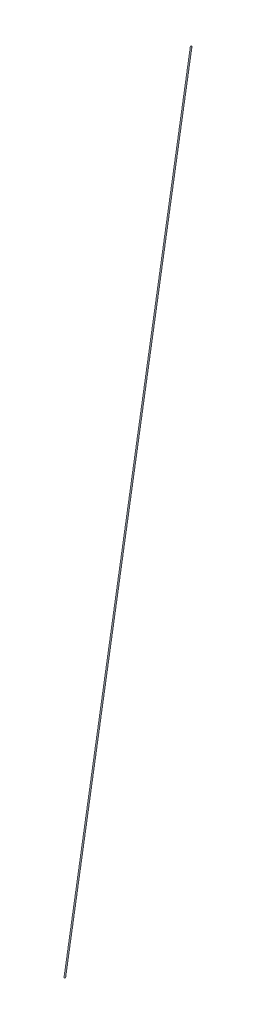
ISO-10303-21;
HEADER;
FILE_DESCRIPTION(('STEP AP214'),'2;1');
FILE_NAME('part.step','',(''),(''),'','','');
FILE_SCHEMA(('AUTOMOTIVE_DESIGN { 1 0 10303 214 1 1 1 1 }'));
ENDSEC;
DATA;
#1=APPLICATION_CONTEXT('core data for automotive mechanical design processes');
#2=APPLICATION_PROTOCOL_DEFINITION('international standard','automotive_design',2000,#1);
#3=PRODUCT_CONTEXT('',#1,'mechanical');
#4=PRODUCT('Part','Part','',(#3));
#5=PRODUCT_RELATED_PRODUCT_CATEGORY('part','',(#4));
#6=PRODUCT_DEFINITION_FORMATION('','',#4);
#7=PRODUCT_DEFINITION_CONTEXT('part definition',#1,'design');
#8=PRODUCT_DEFINITION('design','',#6,#7);
#9=PRODUCT_DEFINITION_SHAPE('','',#8);
#10=(LENGTH_UNIT() NAMED_UNIT(*) SI_UNIT(.MILLI.,.METRE.));
#11=(NAMED_UNIT(*) PLANE_ANGLE_UNIT() SI_UNIT($,.RADIAN.));
#12=(NAMED_UNIT(*) SI_UNIT($,.STERADIAN.) SOLID_ANGLE_UNIT());
#13=UNCERTAINTY_MEASURE_WITH_UNIT(LENGTH_MEASURE(1.E-05),#10,'distance_accuracy_value','');
#14=(GEOMETRIC_REPRESENTATION_CONTEXT(3) GLOBAL_UNCERTAINTY_ASSIGNED_CONTEXT((#13)) GLOBAL_UNIT_ASSIGNED_CONTEXT((#10,
#11,#12)) REPRESENTATION_CONTEXT('',''));
#15=CARTESIAN_POINT('',(0.,0.,0.));
#16=DIRECTION('',(0.,0.,1.));
#17=DIRECTION('',(1.,0.,0.));
#18=AXIS2_PLACEMENT_3D('',#15,#16,#17);
#19=CARTESIAN_POINT('',(0.,2.22044604925031E-13,0.));
#20=DIRECTION('',(0.,0.98585515914511,-0.16759953814665));
#21=DIRECTION('',(0.,0.16759953814665,0.98585515914511));
#22=AXIS2_PLACEMENT_3D('',#19,#20,#21);
#23=PLANE('',#22);
#24=CARTESIAN_POINT('',(0.,2.22044604925031E-13,0.));
#25=DIRECTION('',(0.,0.98585515914511,-0.16759953814665));
#26=DIRECTION('',(0.,0.16759953814665,0.98585515914511));
#27=AXIS2_PLACEMENT_3D('',#24,#25,#26);
#28=CIRCLE('',#27,0.999999999999999);
#29=CARTESIAN_POINT('',(0.,0.167599538146872,0.985855159145053));
#30=VERTEX_POINT('',#29);
#31=EDGE_CURVE('E44',#30,#30,#28,.T.);
#32=ORIENTED_EDGE('',*,*,#31,.F.);
#33=EDGE_LOOP('',(#32));
#34=FACE_BOUND('',#33,.T.);
#35=ADVANCED_FACE('F37',(#34),#23,.F.);
#36=CARTESIAN_POINT('',(0.,1279.38,-217.5));
#37=DIRECTION('',(0.,0.98585515914511,-0.16759953814665));
#38=DIRECTION('',(0.,0.16759953814665,0.98585515914511));
#39=AXIS2_PLACEMENT_3D('',#36,#37,#38);
#40=PLANE('',#39);
#41=CARTESIAN_POINT('',(0.,1279.38,-217.5));
#42=DIRECTION('',(0.,0.98585515914511,-0.16759953814665));
#43=DIRECTION('',(0.,0.16759953814665,0.98585515914511));
#44=AXIS2_PLACEMENT_3D('',#41,#42,#43);
#45=CIRCLE('',#44,0.999999999999999);
#46=CARTESIAN_POINT('',(0.,1279.54759953815,-216.514144840855));
#47=VERTEX_POINT('',#46);
#48=EDGE_CURVE('E10',#47,#47,#45,.T.);
#49=ORIENTED_EDGE('',*,*,#48,.T.);
#50=EDGE_LOOP('',(#49));
#51=FACE_BOUND('',#50,.T.);
#52=ADVANCED_FACE('F54',(#51),#40,.T.);
#53=CARTESIAN_POINT('',(0.,2.22044604925031E-13,0.));
#54=DIRECTION('',(0.,0.98585515914511,-0.16759953814665));
#55=DIRECTION('',(0.,0.16759953814665,0.98585515914511));
#56=AXIS2_PLACEMENT_3D('',#53,#54,#55);
#57=CYLINDRICAL_SURFACE('',#56,0.999999999999999);
#58=ORIENTED_EDGE('',*,*,#48,.F.);
#59=EDGE_LOOP('',(#58));
#60=FACE_BOUND('',#59,.T.);
#61=ORIENTED_EDGE('',*,*,#31,.T.);
#62=EDGE_LOOP('',(#61));
#63=FACE_BOUND('',#62,.T.);
#64=ADVANCED_FACE('F51',(#60,#63),#57,.T.);
#65=CLOSED_SHELL('',(#35,#52,#64));
#66=MANIFOLD_SOLID_BREP('B2',#65);
#67=ADVANCED_BREP_SHAPE_REPRESENTATION('',(#18,#66),#14);
#68=SHAPE_DEFINITION_REPRESENTATION(#9,#67);
ENDSEC;
END-ISO-10303-21;
